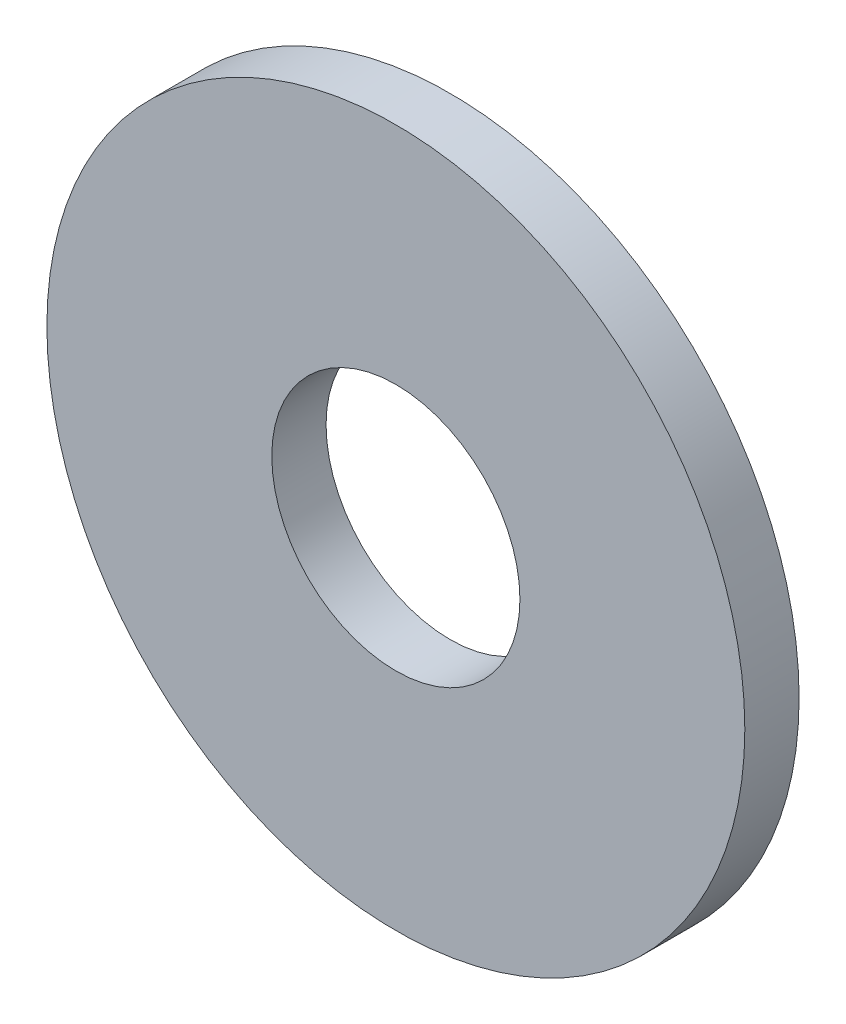
ISO-10303-21;
HEADER;
FILE_DESCRIPTION(('STEP AP214'),'2;1');
FILE_NAME('part.step','',(''),(''),'','','');
FILE_SCHEMA(('AUTOMOTIVE_DESIGN { 1 0 10303 214 1 1 1 1 }'));
ENDSEC;
DATA;
#1=APPLICATION_CONTEXT('core data for automotive mechanical design processes');
#2=APPLICATION_PROTOCOL_DEFINITION('international standard','automotive_design',2000,#1);
#3=PRODUCT_CONTEXT('',#1,'mechanical');
#4=PRODUCT('Part','Part','',(#3));
#5=PRODUCT_RELATED_PRODUCT_CATEGORY('part','',(#4));
#6=PRODUCT_DEFINITION_FORMATION('','',#4);
#7=PRODUCT_DEFINITION_CONTEXT('part definition',#1,'design');
#8=PRODUCT_DEFINITION('design','',#6,#7);
#9=PRODUCT_DEFINITION_SHAPE('','',#8);
#10=(LENGTH_UNIT() NAMED_UNIT(*) SI_UNIT(.MILLI.,.METRE.));
#11=(NAMED_UNIT(*) PLANE_ANGLE_UNIT() SI_UNIT($,.RADIAN.));
#12=(NAMED_UNIT(*) SI_UNIT($,.STERADIAN.) SOLID_ANGLE_UNIT());
#13=UNCERTAINTY_MEASURE_WITH_UNIT(LENGTH_MEASURE(1.E-05),#10,'distance_accuracy_value','');
#14=(GEOMETRIC_REPRESENTATION_CONTEXT(3) GLOBAL_UNCERTAINTY_ASSIGNED_CONTEXT((#13)) GLOBAL_UNIT_ASSIGNED_CONTEXT((#10,
#11,#12)) REPRESENTATION_CONTEXT('',''));
#15=CARTESIAN_POINT('',(0.,0.,0.));
#16=DIRECTION('',(0.,0.,1.));
#17=DIRECTION('',(1.,0.,0.));
#18=AXIS2_PLACEMENT_3D('',#15,#16,#17);
#19=CARTESIAN_POINT('',(0.,0.,-0.7));
#20=DIRECTION('',(0.,0.,1.));
#21=DIRECTION('',(1.,0.,0.));
#22=AXIS2_PLACEMENT_3D('',#19,#20,#21);
#23=CYLINDRICAL_SURFACE('',#22,4.5);
#24=CARTESIAN_POINT('',(0.,0.,-0.7));
#25=DIRECTION('',(0.,0.,1.));
#26=DIRECTION('',(1.,0.,0.));
#27=AXIS2_PLACEMENT_3D('',#24,#25,#26);
#28=CIRCLE('',#27,4.5);
#29=CARTESIAN_POINT('',(4.5,0.,-0.7));
#30=VERTEX_POINT('',#29);
#31=EDGE_CURVE('E10',#30,#30,#28,.T.);
#32=ORIENTED_EDGE('',*,*,#31,.T.);
#33=EDGE_LOOP('',(#32));
#34=FACE_BOUND('',#33,.T.);
#35=CARTESIAN_POINT('',(0.,0.,0.));
#36=DIRECTION('',(0.,0.,1.));
#37=DIRECTION('',(1.,0.,0.));
#38=AXIS2_PLACEMENT_3D('',#35,#36,#37);
#39=CIRCLE('',#38,4.5);
#40=CARTESIAN_POINT('',(4.5,0.,0.));
#41=VERTEX_POINT('',#40);
#42=EDGE_CURVE('E33',#41,#41,#39,.T.);
#43=ORIENTED_EDGE('',*,*,#42,.F.);
#44=EDGE_LOOP('',(#43));
#45=FACE_BOUND('',#44,.T.);
#46=ADVANCED_FACE('F30',(#34,#45),#23,.T.);
#47=CARTESIAN_POINT('',(0.,0.,-0.7));
#48=DIRECTION('',(0.,0.,1.));
#49=DIRECTION('',(1.,0.,0.));
#50=AXIS2_PLACEMENT_3D('',#47,#48,#49);
#51=PLANE('',#50);
#52=CARTESIAN_POINT('',(0.,0.,-0.7));
#53=DIRECTION('',(0.,0.,1.));
#54=DIRECTION('',(1.,0.,0.));
#55=AXIS2_PLACEMENT_3D('',#52,#53,#54);
#56=CIRCLE('',#55,1.6);
#57=CARTESIAN_POINT('',(1.6,0.,-0.7));
#58=VERTEX_POINT('',#57);
#59=EDGE_CURVE('E40',#58,#58,#56,.T.);
#60=ORIENTED_EDGE('',*,*,#59,.T.);
#61=EDGE_LOOP('',(#60));
#62=FACE_BOUND('',#61,.T.);
#63=ORIENTED_EDGE('',*,*,#31,.F.);
#64=EDGE_LOOP('',(#63));
#65=FACE_BOUND('',#64,.T.);
#66=ADVANCED_FACE('F48',(#62,#65),#51,.F.);
#67=CARTESIAN_POINT('',(0.,0.,0.));
#68=DIRECTION('',(0.,0.,1.));
#69=DIRECTION('',(1.,0.,0.));
#70=AXIS2_PLACEMENT_3D('',#67,#68,#69);
#71=PLANE('',#70);
#72=CARTESIAN_POINT('',(0.,0.,0.));
#73=DIRECTION('',(0.,0.,1.));
#74=DIRECTION('',(1.,0.,0.));
#75=AXIS2_PLACEMENT_3D('',#72,#73,#74);
#76=CIRCLE('',#75,1.6);
#77=CARTESIAN_POINT('',(1.6,0.,0.));
#78=VERTEX_POINT('',#77);
#79=EDGE_CURVE('E42',#78,#78,#76,.T.);
#80=ORIENTED_EDGE('',*,*,#79,.F.);
#81=EDGE_LOOP('',(#80));
#82=FACE_BOUND('',#81,.T.);
#83=ORIENTED_EDGE('',*,*,#42,.T.);
#84=EDGE_LOOP('',(#83));
#85=FACE_BOUND('',#84,.T.);
#86=ADVANCED_FACE('F54',(#82,#85),#71,.T.);
#87=CARTESIAN_POINT('',(0.,0.,-0.7));
#88=DIRECTION('',(0.,0.,1.));
#89=DIRECTION('',(1.,0.,0.));
#90=AXIS2_PLACEMENT_3D('',#87,#88,#89);
#91=CYLINDRICAL_SURFACE('',#90,1.6);
#92=ORIENTED_EDGE('',*,*,#59,.F.);
#93=EDGE_LOOP('',(#92));
#94=FACE_BOUND('',#93,.T.);
#95=ORIENTED_EDGE('',*,*,#79,.T.);
#96=EDGE_LOOP('',(#95));
#97=FACE_BOUND('',#96,.T.);
#98=ADVANCED_FACE('F51',(#94,#97),#91,.F.);
#99=CLOSED_SHELL('',(#46,#66,#86,#98));
#100=MANIFOLD_SOLID_BREP('B2',#99);
#101=ADVANCED_BREP_SHAPE_REPRESENTATION('',(#18,#100),#14);
#102=SHAPE_DEFINITION_REPRESENTATION(#9,#101);
ENDSEC;
END-ISO-10303-21;
